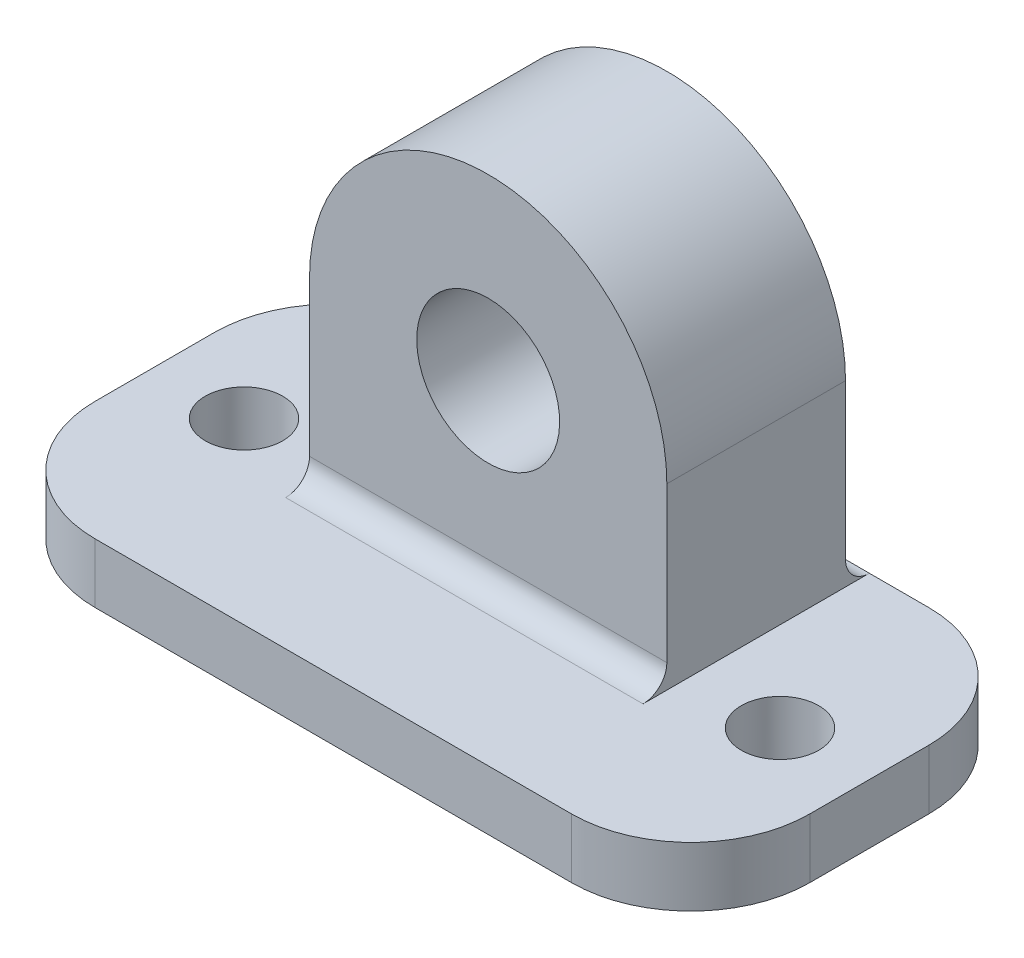
ISO-10303-21;
HEADER;
FILE_DESCRIPTION(('STEP AP214'),'2;1');
FILE_NAME('part.step','',(''),(''),'','','');
FILE_SCHEMA(('AUTOMOTIVE_DESIGN { 1 0 10303 214 1 1 1 1 }'));
ENDSEC;
DATA;
#1=APPLICATION_CONTEXT('core data for automotive mechanical design processes');
#2=APPLICATION_PROTOCOL_DEFINITION('international standard','automotive_design',2000,#1);
#3=PRODUCT_CONTEXT('',#1,'mechanical');
#4=PRODUCT('Part','Part','',(#3));
#5=PRODUCT_RELATED_PRODUCT_CATEGORY('part','',(#4));
#6=PRODUCT_DEFINITION_FORMATION('','',#4);
#7=PRODUCT_DEFINITION_CONTEXT('part definition',#1,'design');
#8=PRODUCT_DEFINITION('design','',#6,#7);
#9=PRODUCT_DEFINITION_SHAPE('','',#8);
#10=(LENGTH_UNIT() NAMED_UNIT(*) SI_UNIT(.MILLI.,.METRE.));
#11=(NAMED_UNIT(*) PLANE_ANGLE_UNIT() SI_UNIT($,.RADIAN.));
#12=(NAMED_UNIT(*) SI_UNIT($,.STERADIAN.) SOLID_ANGLE_UNIT());
#13=UNCERTAINTY_MEASURE_WITH_UNIT(LENGTH_MEASURE(1.E-05),#10,'distance_accuracy_value','');
#14=(GEOMETRIC_REPRESENTATION_CONTEXT(3) GLOBAL_UNCERTAINTY_ASSIGNED_CONTEXT((#13)) GLOBAL_UNIT_ASSIGNED_CONTEXT((#10,
#11,#12)) REPRESENTATION_CONTEXT('',''));
#15=CARTESIAN_POINT('',(0.,0.,0.));
#16=DIRECTION('',(0.,0.,1.));
#17=DIRECTION('',(1.,0.,0.));
#18=AXIS2_PLACEMENT_3D('',#15,#16,#17);
#19=CARTESIAN_POINT('',(0.,16.6666666666667,30.));
#20=DIRECTION('',(0.,0.,1.));
#21=DIRECTION('',(1.,0.,0.));
#22=AXIS2_PLACEMENT_3D('',#19,#20,#21);
#23=PLANE('',#22);
#24=DIRECTION('',(1.,0.,0.));
#25=VECTOR('',#24,1.);
#26=CARTESIAN_POINT('',(-30.,-3.33333333333333,30.));
#27=LINE('',#26,#25);
#28=CARTESIAN_POINT('',(-20.,-3.33333333333333,30.));
#29=VERTEX_POINT('',#28);
#30=CARTESIAN_POINT('',(20.,-3.33333333333333,30.));
#31=VERTEX_POINT('',#30);
#32=EDGE_CURVE('E254',#29,#31,#27,.T.);
#33=ORIENTED_EDGE('',*,*,#32,.T.);
#34=DIRECTION('',(0.,1.,0.));
#35=VECTOR('',#34,1.);
#36=CARTESIAN_POINT('',(20.,1.66666666666668,30.));
#37=LINE('',#36,#35);
#38=CARTESIAN_POINT('',(20.,1.66666666666667,30.));
#39=VERTEX_POINT('',#38);
#40=EDGE_CURVE('E235',#31,#39,#37,.T.);
#41=ORIENTED_EDGE('',*,*,#40,.T.);
#42=DIRECTION('',(-1.,0.,0.));
#43=VECTOR('',#42,1.);
#44=CARTESIAN_POINT('',(15.,1.66666666666667,30.));
#45=LINE('',#44,#43);
#46=CARTESIAN_POINT('',(-20.,1.66666666666667,30.));
#47=VERTEX_POINT('',#46);
#48=EDGE_CURVE('E266',#39,#47,#45,.T.);
#49=ORIENTED_EDGE('',*,*,#48,.T.);
#50=DIRECTION('',(0.,-1.,0.));
#51=VECTOR('',#50,1.);
#52=CARTESIAN_POINT('',(-20.,-3.33333333333333,30.));
#53=LINE('',#52,#51);
#54=EDGE_CURVE('E232',#47,#29,#53,.T.);
#55=ORIENTED_EDGE('',*,*,#54,.T.);
#56=EDGE_LOOP('',(#33,#41,#49,#55));
#57=FACE_BOUND('',#56,.T.);
#58=ADVANCED_FACE('F34',(#57),#23,.T.);
#59=CARTESIAN_POINT('',(0.,16.6666666666667,0.));
#60=DIRECTION('',(0.,0.,1.));
#61=DIRECTION('',(1.,0.,0.));
#62=AXIS2_PLACEMENT_3D('',#59,#60,#61);
#63=PLANE('',#62);
#64=DIRECTION('',(1.,0.,0.));
#65=VECTOR('',#64,1.);
#66=CARTESIAN_POINT('',(-30.,-3.33333333333333,0.));
#67=LINE('',#66,#65);
#68=CARTESIAN_POINT('',(-20.,-3.33333333333333,0.));
#69=VERTEX_POINT('',#68);
#70=CARTESIAN_POINT('',(20.,-3.33333333333333,0.));
#71=VERTEX_POINT('',#70);
#72=EDGE_CURVE('E261',#69,#71,#67,.T.);
#73=ORIENTED_EDGE('',*,*,#72,.F.);
#74=DIRECTION('',(0.,-1.,0.));
#75=VECTOR('',#74,1.);
#76=CARTESIAN_POINT('',(-20.,16.6666666666667,0.));
#77=LINE('',#76,#75);
#78=CARTESIAN_POINT('',(-20.,1.66666666666667,0.));
#79=VERTEX_POINT('',#78);
#80=EDGE_CURVE('E224',#69,#79,#77,.F.);
#81=ORIENTED_EDGE('',*,*,#80,.T.);
#82=DIRECTION('',(-1.,0.,0.));
#83=VECTOR('',#82,1.);
#84=CARTESIAN_POINT('',(-30.,1.66666666666667,0.));
#85=LINE('',#84,#83);
#86=CARTESIAN_POINT('',(-15.,1.66666666666667,0.));
#87=VERTEX_POINT('',#86);
#88=EDGE_CURVE('E256',#87,#79,#85,.T.);
#89=ORIENTED_EDGE('',*,*,#88,.F.);
#90=CARTESIAN_POINT('',(15.,1.66666666666667,0.));
#91=VERTEX_POINT('',#90);
#92=EDGE_CURVE('E253',#91,#87,#85,.T.);
#93=ORIENTED_EDGE('',*,*,#92,.F.);
#94=CARTESIAN_POINT('',(20.,1.66666666666667,0.));
#95=VERTEX_POINT('',#94);
#96=EDGE_CURVE('E245',#95,#91,#85,.T.);
#97=ORIENTED_EDGE('',*,*,#96,.F.);
#98=DIRECTION('',(0.,1.,0.));
#99=VECTOR('',#98,1.);
#100=CARTESIAN_POINT('',(20.,16.6666666666667,0.));
#101=LINE('',#100,#99);
#102=EDGE_CURVE('E222',#95,#71,#101,.F.);
#103=ORIENTED_EDGE('',*,*,#102,.T.);
#104=EDGE_LOOP('',(#73,#81,#89,#93,#97,#103));
#105=FACE_BOUND('',#104,.T.);
#106=ADVANCED_FACE('F249',(#105),#63,.F.);
#107=CARTESIAN_POINT('',(-30.,1.66666666666667,30.));
#108=DIRECTION('',(1.,0.,0.));
#109=DIRECTION('',(0.,0.,-1.));
#110=AXIS2_PLACEMENT_3D('',#107,#108,#109);
#111=PLANE('',#110);
#112=DIRECTION('',(0.,0.,-1.));
#113=VECTOR('',#112,1.);
#114=CARTESIAN_POINT('',(-30.,1.66666666666667,30.));
#115=LINE('',#114,#113);
#116=CARTESIAN_POINT('',(-30.,1.66666666666667,20.));
#117=VERTEX_POINT('',#116);
#118=CARTESIAN_POINT('',(-30.,1.66666666666667,10.));
#119=VERTEX_POINT('',#118);
#120=EDGE_CURVE('E269',#117,#119,#115,.T.);
#121=ORIENTED_EDGE('',*,*,#120,.T.);
#122=DIRECTION('',(0.,-1.,0.));
#123=VECTOR('',#122,1.);
#124=CARTESIAN_POINT('',(-30.,1.66666666666667,10.));
#125=LINE('',#124,#123);
#126=CARTESIAN_POINT('',(-30.,-3.33333333333333,10.));
#127=VERTEX_POINT('',#126);
#128=EDGE_CURVE('E211',#119,#127,#125,.T.);
#129=ORIENTED_EDGE('',*,*,#128,.T.);
#130=DIRECTION('',(0.,0.,-1.));
#131=VECTOR('',#130,1.);
#132=CARTESIAN_POINT('',(-30.,-3.33333333333333,30.));
#133=LINE('',#132,#131);
#134=CARTESIAN_POINT('',(-30.,-3.33333333333333,20.));
#135=VERTEX_POINT('',#134);
#136=EDGE_CURVE('E177',#135,#127,#133,.T.);
#137=ORIENTED_EDGE('',*,*,#136,.F.);
#138=DIRECTION('',(0.,-1.,0.));
#139=VECTOR('',#138,1.);
#140=CARTESIAN_POINT('',(-30.,1.66666666666667,20.));
#141=LINE('',#140,#139);
#142=EDGE_CURVE('E209',#135,#117,#141,.F.);
#143=ORIENTED_EDGE('',*,*,#142,.T.);
#144=EDGE_LOOP('',(#121,#129,#137,#143));
#145=FACE_BOUND('',#144,.T.);
#146=ADVANCED_FACE('F300',(#145),#111,.F.);
#147=CARTESIAN_POINT('',(-30.,-3.33333333333333,30.));
#148=DIRECTION('',(0.,1.,0.));
#149=DIRECTION('',(-1.,0.,0.));
#150=AXIS2_PLACEMENT_3D('',#147,#148,#149);
#151=PLANE('',#150);
#152=CARTESIAN_POINT('',(-22.5,-3.33333333333333,15.));
#153=DIRECTION('',(0.,1.,0.));
#154=DIRECTION('',(-1.,0.,0.));
#155=AXIS2_PLACEMENT_3D('',#152,#153,#154);
#156=CIRCLE('',#155,3.25);
#157=CARTESIAN_POINT('',(-25.75,-3.33333333333333,15.));
#158=VERTEX_POINT('',#157);
#159=EDGE_CURVE('E158',#158,#158,#156,.T.);
#160=ORIENTED_EDGE('',*,*,#159,.T.);
#161=EDGE_LOOP('',(#160));
#162=FACE_BOUND('',#161,.T.);
#163=CARTESIAN_POINT('',(22.5,-3.33333333333332,15.));
#164=DIRECTION('',(0.,1.,0.));
#165=DIRECTION('',(-1.,0.,0.));
#166=AXIS2_PLACEMENT_3D('',#163,#164,#165);
#167=CIRCLE('',#166,3.25);
#168=CARTESIAN_POINT('',(19.25,-3.33333333333332,15.));
#169=VERTEX_POINT('',#168);
#170=EDGE_CURVE('E189',#169,#169,#167,.T.);
#171=ORIENTED_EDGE('',*,*,#170,.T.);
#172=EDGE_LOOP('',(#171));
#173=FACE_BOUND('',#172,.T.);
#174=ORIENTED_EDGE('',*,*,#136,.T.);
#175=CARTESIAN_POINT('',(-20.,-3.33333333333333,10.));
#176=DIRECTION('',(0.,1.,0.));
#177=DIRECTION('',(-1.,0.,0.));
#178=AXIS2_PLACEMENT_3D('',#175,#176,#177);
#179=CIRCLE('',#178,10.);
#180=EDGE_CURVE('E220',#127,#69,#179,.F.);
#181=ORIENTED_EDGE('',*,*,#180,.T.);
#182=ORIENTED_EDGE('',*,*,#72,.T.);
#183=CARTESIAN_POINT('',(20.,-3.33333333333333,10.));
#184=DIRECTION('',(0.,1.,0.));
#185=DIRECTION('',(-1.,0.,0.));
#186=AXIS2_PLACEMENT_3D('',#183,#184,#185);
#187=CIRCLE('',#186,10.);
#188=CARTESIAN_POINT('',(30.,-3.33333333333332,10.));
#189=VERTEX_POINT('',#188);
#190=EDGE_CURVE('E216',#71,#189,#187,.F.);
#191=ORIENTED_EDGE('',*,*,#190,.T.);
#192=DIRECTION('',(0.,0.,-1.));
#193=VECTOR('',#192,1.);
#194=CARTESIAN_POINT('',(30.,-3.33333333333332,30.));
#195=LINE('',#194,#193);
#196=CARTESIAN_POINT('',(30.,-3.33333333333332,20.));
#197=VERTEX_POINT('',#196);
#198=EDGE_CURVE('E174',#197,#189,#195,.T.);
#199=ORIENTED_EDGE('',*,*,#198,.F.);
#200=CARTESIAN_POINT('',(20.,-3.33333333333332,20.));
#201=DIRECTION('',(0.,1.,0.));
#202=DIRECTION('',(-1.,0.,0.));
#203=AXIS2_PLACEMENT_3D('',#200,#201,#202);
#204=CIRCLE('',#203,10.);
#205=EDGE_CURVE('E218',#197,#31,#204,.F.);
#206=ORIENTED_EDGE('',*,*,#205,.T.);
#207=ORIENTED_EDGE('',*,*,#32,.F.);
#208=CARTESIAN_POINT('',(-20.,-3.33333333333333,20.));
#209=DIRECTION('',(0.,1.,0.));
#210=DIRECTION('',(-1.,0.,0.));
#211=AXIS2_PLACEMENT_3D('',#208,#209,#210);
#212=CIRCLE('',#211,10.);
#213=EDGE_CURVE('E214',#29,#135,#212,.F.);
#214=ORIENTED_EDGE('',*,*,#213,.T.);
#215=EDGE_LOOP('',(#174,#181,#182,#191,#199,#206,#207,#214));
#216=FACE_BOUND('',#215,.T.);
#217=ADVANCED_FACE('F259',(#162,#173,#216),#151,.F.);
#218=CARTESIAN_POINT('',(30.,1.66666666666668,30.));
#219=DIRECTION('',(-1.,0.,0.));
#220=DIRECTION('',(0.,0.,1.));
#221=AXIS2_PLACEMENT_3D('',#218,#219,#220);
#222=PLANE('',#221);
#223=DIRECTION('',(0.,0.,-1.));
#224=VECTOR('',#223,1.);
#225=CARTESIAN_POINT('',(30.,1.66666666666668,30.));
#226=LINE('',#225,#224);
#227=CARTESIAN_POINT('',(30.,1.66666666666668,20.));
#228=VERTEX_POINT('',#227);
#229=CARTESIAN_POINT('',(30.,1.66666666666668,10.));
#230=VERTEX_POINT('',#229);
#231=EDGE_CURVE('E167',#228,#230,#226,.T.);
#232=ORIENTED_EDGE('',*,*,#231,.F.);
#233=DIRECTION('',(0.,1.,0.));
#234=VECTOR('',#233,1.);
#235=CARTESIAN_POINT('',(30.,-3.33333333333332,20.));
#236=LINE('',#235,#234);
#237=EDGE_CURVE('E11',#228,#197,#236,.F.);
#238=ORIENTED_EDGE('',*,*,#237,.T.);
#239=ORIENTED_EDGE('',*,*,#198,.T.);
#240=DIRECTION('',(0.,1.,0.));
#241=VECTOR('',#240,1.);
#242=CARTESIAN_POINT('',(30.,1.66666666666668,10.));
#243=LINE('',#242,#241);
#244=EDGE_CURVE('E42',#189,#230,#243,.T.);
#245=ORIENTED_EDGE('',*,*,#244,.T.);
#246=EDGE_LOOP('',(#232,#238,#239,#245));
#247=FACE_BOUND('',#246,.T.);
#248=ADVANCED_FACE('F238',(#247),#222,.F.);
#249=CARTESIAN_POINT('',(15.,16.6666666666667,30.));
#250=DIRECTION('',(-1.,0.,0.));
#251=DIRECTION('',(0.,0.,1.));
#252=AXIS2_PLACEMENT_3D('',#249,#250,#251);
#253=PLANE('',#252);
#254=DIRECTION('',(0.,0.,-1.));
#255=VECTOR('',#254,1.);
#256=CARTESIAN_POINT('',(15.,16.6666666666667,30.));
#257=LINE('',#256,#255);
#258=CARTESIAN_POINT('',(15.,16.6666666666667,17.));
#259=VERTEX_POINT('',#258);
#260=CARTESIAN_POINT('',(15.,16.6666666666667,2.));
#261=VERTEX_POINT('',#260);
#262=EDGE_CURVE('E154',#259,#261,#257,.T.);
#263=ORIENTED_EDGE('',*,*,#262,.F.);
#264=DIRECTION('',(0.,1.,0.));
#265=VECTOR('',#264,1.);
#266=CARTESIAN_POINT('',(15.,31.6666666666667,17.));
#267=LINE('',#266,#265);
#268=CARTESIAN_POINT('',(15.,3.66666666666668,17.));
#269=VERTEX_POINT('',#268);
#270=EDGE_CURVE('E351',#269,#259,#267,.T.);
#271=ORIENTED_EDGE('',*,*,#270,.F.);
#272=CARTESIAN_POINT('',(15.,3.66666666666668,19.));
#273=DIRECTION('',(-1.,0.,0.));
#274=DIRECTION('',(0.,0.,1.));
#275=AXIS2_PLACEMENT_3D('',#272,#273,#274);
#276=CIRCLE('',#275,2.);
#277=CARTESIAN_POINT('',(15.,1.66666666666667,19.));
#278=VERTEX_POINT('',#277);
#279=EDGE_CURVE('E204',#269,#278,#276,.T.);
#280=ORIENTED_EDGE('',*,*,#279,.T.);
#281=DIRECTION('',(0.,0.,-1.));
#282=VECTOR('',#281,1.);
#283=CARTESIAN_POINT('',(15.,1.66666666666667,30.));
#284=LINE('',#283,#282);
#285=EDGE_CURVE('E164',#278,#91,#284,.T.);
#286=ORIENTED_EDGE('',*,*,#285,.T.);
#287=CARTESIAN_POINT('',(15.,3.66666666666667,0.));
#288=DIRECTION('',(-1.,0.,0.));
#289=DIRECTION('',(0.,0.,1.));
#290=AXIS2_PLACEMENT_3D('',#287,#288,#289);
#291=CIRCLE('',#290,2.);
#292=CARTESIAN_POINT('',(15.,3.66666666666668,2.));
#293=VERTEX_POINT('',#292);
#294=EDGE_CURVE('E157',#91,#293,#291,.T.);
#295=ORIENTED_EDGE('',*,*,#294,.T.);
#296=DIRECTION('',(0.,-1.,0.));
#297=VECTOR('',#296,1.);
#298=CARTESIAN_POINT('',(15.,31.6666666666667,2.));
#299=LINE('',#298,#297);
#300=EDGE_CURVE('E139',#261,#293,#299,.T.);
#301=ORIENTED_EDGE('',*,*,#300,.F.);
#302=EDGE_LOOP('',(#263,#271,#280,#286,#295,#301));
#303=FACE_BOUND('',#302,.T.);
#304=ADVANCED_FACE('F152',(#303),#253,.F.);
#305=CARTESIAN_POINT('',(0.,16.6666666666667,30.));
#306=DIRECTION('',(0.,0.,-1.));
#307=DIRECTION('',(-1.,0.,0.));
#308=AXIS2_PLACEMENT_3D('',#305,#306,#307);
#309=CYLINDRICAL_SURFACE('',#308,15.);
#310=CARTESIAN_POINT('',(0.,16.6666666666667,17.));
#311=DIRECTION('',(0.,0.,-1.));
#312=DIRECTION('',(0.,1.,0.));
#313=AXIS2_PLACEMENT_3D('',#310,#311,#312);
#314=CIRCLE('',#313,15.);
#315=CARTESIAN_POINT('',(-15.,16.6666666666667,17.));
#316=VERTEX_POINT('',#315);
#317=EDGE_CURVE('E163',#316,#259,#314,.T.);
#318=ORIENTED_EDGE('',*,*,#317,.T.);
#319=ORIENTED_EDGE('',*,*,#262,.T.);
#320=CARTESIAN_POINT('',(0.,16.6666666666667,2.));
#321=DIRECTION('',(0.,0.,1.));
#322=DIRECTION('',(1.,0.,0.));
#323=AXIS2_PLACEMENT_3D('',#320,#321,#322);
#324=CIRCLE('',#323,15.);
#325=CARTESIAN_POINT('',(-15.,16.6666666666667,2.));
#326=VERTEX_POINT('',#325);
#327=EDGE_CURVE('E136',#261,#326,#324,.T.);
#328=ORIENTED_EDGE('',*,*,#327,.T.);
#329=DIRECTION('',(0.,0.,-1.));
#330=VECTOR('',#329,1.);
#331=CARTESIAN_POINT('',(-15.,16.6666666666667,30.));
#332=LINE('',#331,#330);
#333=EDGE_CURVE('E165',#316,#326,#332,.T.);
#334=ORIENTED_EDGE('',*,*,#333,.F.);
#335=EDGE_LOOP('',(#318,#319,#328,#334));
#336=FACE_BOUND('',#335,.T.);
#337=ADVANCED_FACE('F161',(#336),#309,.T.);
#338=CARTESIAN_POINT('',(-15.,16.6666666666667,30.));
#339=DIRECTION('',(1.,0.,0.));
#340=DIRECTION('',(0.,0.,-1.));
#341=AXIS2_PLACEMENT_3D('',#338,#339,#340);
#342=PLANE('',#341);
#343=DIRECTION('',(0.,0.,-1.));
#344=VECTOR('',#343,1.);
#345=CARTESIAN_POINT('',(-15.,1.66666666666667,30.));
#346=LINE('',#345,#344);
#347=CARTESIAN_POINT('',(-15.,1.66666666666667,19.));
#348=VERTEX_POINT('',#347);
#349=EDGE_CURVE('E169',#348,#87,#346,.T.);
#350=ORIENTED_EDGE('',*,*,#349,.F.);
#351=CARTESIAN_POINT('',(-15.,3.66666666666667,19.));
#352=DIRECTION('',(1.,0.,0.));
#353=DIRECTION('',(0.,0.,-1.));
#354=AXIS2_PLACEMENT_3D('',#351,#352,#353);
#355=CIRCLE('',#354,2.);
#356=CARTESIAN_POINT('',(-15.,3.66666666666667,17.));
#357=VERTEX_POINT('',#356);
#358=EDGE_CURVE('E207',#348,#357,#355,.T.);
#359=ORIENTED_EDGE('',*,*,#358,.T.);
#360=DIRECTION('',(0.,1.,0.));
#361=VECTOR('',#360,1.);
#362=CARTESIAN_POINT('',(-15.,31.6666666666667,17.));
#363=LINE('',#362,#361);
#364=EDGE_CURVE('E183',#357,#316,#363,.T.);
#365=ORIENTED_EDGE('',*,*,#364,.T.);
#366=ORIENTED_EDGE('',*,*,#333,.T.);
#367=DIRECTION('',(0.,-1.,0.));
#368=VECTOR('',#367,1.);
#369=CARTESIAN_POINT('',(-15.,31.6666666666667,2.));
#370=LINE('',#369,#368);
#371=CARTESIAN_POINT('',(-15.,3.66666666666668,2.));
#372=VERTEX_POINT('',#371);
#373=EDGE_CURVE('E142',#326,#372,#370,.T.);
#374=ORIENTED_EDGE('',*,*,#373,.T.);
#375=CARTESIAN_POINT('',(-15.,3.66666666666667,0.));
#376=DIRECTION('',(1.,0.,0.));
#377=DIRECTION('',(0.,0.,-1.));
#378=AXIS2_PLACEMENT_3D('',#375,#376,#377);
#379=CIRCLE('',#378,2.);
#380=EDGE_CURVE('E201',#372,#87,#379,.T.);
#381=ORIENTED_EDGE('',*,*,#380,.T.);
#382=EDGE_LOOP('',(#350,#359,#365,#366,#374,#381));
#383=FACE_BOUND('',#382,.T.);
#384=ADVANCED_FACE('F276',(#383),#342,.F.);
#385=CARTESIAN_POINT('',(-30.,1.66666666666667,30.));
#386=DIRECTION('',(0.,-1.,0.));
#387=DIRECTION('',(1.,0.,0.));
#388=AXIS2_PLACEMENT_3D('',#385,#386,#387);
#389=PLANE('',#388);
#390=CARTESIAN_POINT('',(-22.5,1.66666666666667,15.));
#391=DIRECTION('',(0.,-1.,0.));
#392=DIRECTION('',(1.,0.,0.));
#393=AXIS2_PLACEMENT_3D('',#390,#391,#392);
#394=CIRCLE('',#393,3.25);
#395=CARTESIAN_POINT('',(-19.25,1.66666666666667,15.));
#396=VERTEX_POINT('',#395);
#397=EDGE_CURVE('E190',#396,#396,#394,.T.);
#398=ORIENTED_EDGE('',*,*,#397,.T.);
#399=EDGE_LOOP('',(#398));
#400=FACE_BOUND('',#399,.T.);
#401=CARTESIAN_POINT('',(22.5,1.66666666666668,15.));
#402=DIRECTION('',(0.,-1.,0.));
#403=DIRECTION('',(1.,0.,0.));
#404=AXIS2_PLACEMENT_3D('',#401,#402,#403);
#405=CIRCLE('',#404,3.25);
#406=CARTESIAN_POINT('',(25.75,1.66666666666668,15.));
#407=VERTEX_POINT('',#406);
#408=EDGE_CURVE('E186',#407,#407,#405,.T.);
#409=ORIENTED_EDGE('',*,*,#408,.T.);
#410=EDGE_LOOP('',(#409));
#411=FACE_BOUND('',#410,.T.);
#412=ORIENTED_EDGE('',*,*,#88,.T.);
#413=CARTESIAN_POINT('',(-20.,1.66666666666667,10.));
#414=DIRECTION('',(0.,-1.,0.));
#415=DIRECTION('',(1.,0.,0.));
#416=AXIS2_PLACEMENT_3D('',#413,#414,#415);
#417=CIRCLE('',#416,10.);
#418=EDGE_CURVE('E230',#79,#119,#417,.F.);
#419=ORIENTED_EDGE('',*,*,#418,.T.);
#420=ORIENTED_EDGE('',*,*,#120,.F.);
#421=CARTESIAN_POINT('',(-20.,1.66666666666667,20.));
#422=DIRECTION('',(0.,-1.,0.));
#423=DIRECTION('',(1.,0.,0.));
#424=AXIS2_PLACEMENT_3D('',#421,#422,#423);
#425=CIRCLE('',#424,10.);
#426=EDGE_CURVE('E226',#117,#47,#425,.F.);
#427=ORIENTED_EDGE('',*,*,#426,.T.);
#428=ORIENTED_EDGE('',*,*,#48,.F.);
#429=CARTESIAN_POINT('',(20.,1.66666666666667,20.));
#430=DIRECTION('',(0.,-1.,0.));
#431=DIRECTION('',(1.,0.,0.));
#432=AXIS2_PLACEMENT_3D('',#429,#430,#431);
#433=CIRCLE('',#432,10.);
#434=EDGE_CURVE('E57',#39,#228,#433,.F.);
#435=ORIENTED_EDGE('',*,*,#434,.T.);
#436=ORIENTED_EDGE('',*,*,#231,.T.);
#437=CARTESIAN_POINT('',(20.,1.66666666666667,10.));
#438=DIRECTION('',(0.,-1.,0.));
#439=DIRECTION('',(1.,0.,0.));
#440=AXIS2_PLACEMENT_3D('',#437,#438,#439);
#441=CIRCLE('',#440,10.);
#442=EDGE_CURVE('E49',#230,#95,#441,.F.);
#443=ORIENTED_EDGE('',*,*,#442,.T.);
#444=ORIENTED_EDGE('',*,*,#96,.T.);
#445=ORIENTED_EDGE('',*,*,#285,.F.);
#446=DIRECTION('',(1.,0.,0.));
#447=VECTOR('',#446,1.);
#448=CARTESIAN_POINT('',(-15.,1.66666666666667,19.));
#449=LINE('',#448,#447);
#450=EDGE_CURVE('E180',#278,#348,#449,.F.);
#451=ORIENTED_EDGE('',*,*,#450,.T.);
#452=ORIENTED_EDGE('',*,*,#349,.T.);
#453=EDGE_LOOP('',(#412,#419,#420,#427,#428,#435,#436,#443,#444,#445,#451,#452));
#454=FACE_BOUND('',#453,.T.);
#455=ADVANCED_FACE('F243',(#400,#411,#454),#389,.F.);
#456=CARTESIAN_POINT('',(-15.,31.6666666666667,2.));
#457=DIRECTION('',(0.,0.,1.));
#458=DIRECTION('',(1.,0.,0.));
#459=AXIS2_PLACEMENT_3D('',#456,#457,#458);
#460=PLANE('',#459);
#461=CARTESIAN_POINT('',(0.,16.6666666666667,2.));
#462=DIRECTION('',(0.,0.,1.));
#463=DIRECTION('',(1.,0.,0.));
#464=AXIS2_PLACEMENT_3D('',#461,#462,#463);
#465=CIRCLE('',#464,6.);
#466=CARTESIAN_POINT('',(6.,16.6666666666667,2.));
#467=VERTEX_POINT('',#466);
#468=EDGE_CURVE('E148',#467,#467,#465,.T.);
#469=ORIENTED_EDGE('',*,*,#468,.T.);
#470=EDGE_LOOP('',(#469));
#471=FACE_BOUND('',#470,.T.);
#472=ORIENTED_EDGE('',*,*,#300,.T.);
#473=DIRECTION('',(1.,0.,0.));
#474=VECTOR('',#473,1.);
#475=CARTESIAN_POINT('',(-15.,3.66666666666667,2.));
#476=LINE('',#475,#474);
#477=EDGE_CURVE('E195',#293,#372,#476,.F.);
#478=ORIENTED_EDGE('',*,*,#477,.T.);
#479=ORIENTED_EDGE('',*,*,#373,.F.);
#480=ORIENTED_EDGE('',*,*,#327,.F.);
#481=EDGE_LOOP('',(#472,#478,#479,#480));
#482=FACE_BOUND('',#481,.T.);
#483=ADVANCED_FACE('F138',(#471,#482),#460,.F.);
#484=CARTESIAN_POINT('',(-15.,31.6666666666667,17.));
#485=DIRECTION('',(0.,0.,-1.));
#486=DIRECTION('',(0.,1.,0.));
#487=AXIS2_PLACEMENT_3D('',#484,#485,#486);
#488=PLANE('',#487);
#489=CARTESIAN_POINT('',(0.,16.6666666666667,17.));
#490=DIRECTION('',(0.,0.,-1.));
#491=DIRECTION('',(0.,1.,0.));
#492=AXIS2_PLACEMENT_3D('',#489,#490,#491);
#493=CIRCLE('',#492,6.);
#494=CARTESIAN_POINT('',(0.,22.6666666666667,17.));
#495=VERTEX_POINT('',#494);
#496=EDGE_CURVE('E147',#495,#495,#493,.T.);
#497=ORIENTED_EDGE('',*,*,#496,.T.);
#498=EDGE_LOOP('',(#497));
#499=FACE_BOUND('',#498,.T.);
#500=ORIENTED_EDGE('',*,*,#364,.F.);
#501=DIRECTION('',(1.,0.,0.));
#502=VECTOR('',#501,1.);
#503=CARTESIAN_POINT('',(15.,3.66666666666668,17.));
#504=LINE('',#503,#502);
#505=EDGE_CURVE('E197',#357,#269,#504,.T.);
#506=ORIENTED_EDGE('',*,*,#505,.T.);
#507=ORIENTED_EDGE('',*,*,#270,.T.);
#508=ORIENTED_EDGE('',*,*,#317,.F.);
#509=EDGE_LOOP('',(#500,#506,#507,#508));
#510=FACE_BOUND('',#509,.T.);
#511=ADVANCED_FACE('F366',(#499,#510),#488,.F.);
#512=CARTESIAN_POINT('',(0.,16.6666666666667,30.));
#513=DIRECTION('',(0.,0.,-1.));
#514=DIRECTION('',(-1.,0.,0.));
#515=AXIS2_PLACEMENT_3D('',#512,#513,#514);
#516=CYLINDRICAL_SURFACE('',#515,6.);
#517=ORIENTED_EDGE('',*,*,#496,.F.);
#518=EDGE_LOOP('',(#517));
#519=FACE_BOUND('',#518,.T.);
#520=ORIENTED_EDGE('',*,*,#468,.F.);
#521=EDGE_LOOP('',(#520));
#522=FACE_BOUND('',#521,.T.);
#523=ADVANCED_FACE('F304',(#519,#522),#516,.F.);
#524=CARTESIAN_POINT('',(22.5,-15.,15.));
#525=DIRECTION('',(0.,1.,0.));
#526=DIRECTION('',(0.,0.,1.));
#527=AXIS2_PLACEMENT_3D('',#524,#525,#526);
#528=CYLINDRICAL_SURFACE('',#527,3.25);
#529=ORIENTED_EDGE('',*,*,#408,.F.);
#530=EDGE_LOOP('',(#529));
#531=FACE_BOUND('',#530,.T.);
#532=ORIENTED_EDGE('',*,*,#170,.F.);
#533=EDGE_LOOP('',(#532));
#534=FACE_BOUND('',#533,.T.);
#535=ADVANCED_FACE('F290',(#531,#534),#528,.F.);
#536=CARTESIAN_POINT('',(-22.5,-15.,15.));
#537=DIRECTION('',(0.,1.,0.));
#538=DIRECTION('',(0.,0.,1.));
#539=AXIS2_PLACEMENT_3D('',#536,#537,#538);
#540=CYLINDRICAL_SURFACE('',#539,3.25);
#541=ORIENTED_EDGE('',*,*,#397,.F.);
#542=EDGE_LOOP('',(#541));
#543=FACE_BOUND('',#542,.T.);
#544=ORIENTED_EDGE('',*,*,#159,.F.);
#545=EDGE_LOOP('',(#544));
#546=FACE_BOUND('',#545,.T.);
#547=ADVANCED_FACE('F281',(#543,#546),#540,.F.);
#548=CARTESIAN_POINT('',(-30.,3.66666666666667,0.));
#549=DIRECTION('',(-1.,0.,0.));
#550=DIRECTION('',(0.,-1.,0.));
#551=AXIS2_PLACEMENT_3D('',#548,#549,#550);
#552=CYLINDRICAL_SURFACE('',#551,2.);
#553=ORIENTED_EDGE('',*,*,#380,.F.);
#554=ORIENTED_EDGE('',*,*,#477,.F.);
#555=ORIENTED_EDGE('',*,*,#294,.F.);
#556=ORIENTED_EDGE('',*,*,#92,.T.);
#557=EDGE_LOOP('',(#553,#554,#555,#556));
#558=FACE_BOUND('',#557,.T.);
#559=ADVANCED_FACE('F278',(#558),#552,.F.);
#560=CARTESIAN_POINT('',(-15.,3.66666666666667,19.));
#561=DIRECTION('',(-1.,0.,0.));
#562=DIRECTION('',(0.,-1.,0.));
#563=AXIS2_PLACEMENT_3D('',#560,#561,#562);
#564=CYLINDRICAL_SURFACE('',#563,2.);
#565=ORIENTED_EDGE('',*,*,#358,.F.);
#566=ORIENTED_EDGE('',*,*,#450,.F.);
#567=ORIENTED_EDGE('',*,*,#279,.F.);
#568=ORIENTED_EDGE('',*,*,#505,.F.);
#569=EDGE_LOOP('',(#565,#566,#567,#568));
#570=FACE_BOUND('',#569,.T.);
#571=ADVANCED_FACE('F280',(#570),#564,.F.);
#572=CARTESIAN_POINT('',(-20.,1.66666666666667,10.));
#573=DIRECTION('',(0.,-1.,0.));
#574=DIRECTION('',(0.,0.,-1.));
#575=AXIS2_PLACEMENT_3D('',#572,#573,#574);
#576=CYLINDRICAL_SURFACE('',#575,10.);
#577=ORIENTED_EDGE('',*,*,#418,.F.);
#578=ORIENTED_EDGE('',*,*,#80,.F.);
#579=ORIENTED_EDGE('',*,*,#180,.F.);
#580=ORIENTED_EDGE('',*,*,#128,.F.);
#581=EDGE_LOOP('',(#577,#578,#579,#580));
#582=FACE_BOUND('',#581,.T.);
#583=ADVANCED_FACE('F287',(#582),#576,.T.);
#584=CARTESIAN_POINT('',(20.,16.6666666666667,20.));
#585=DIRECTION('',(0.,-1.,0.));
#586=DIRECTION('',(0.,0.,-1.));
#587=AXIS2_PLACEMENT_3D('',#584,#585,#586);
#588=CYLINDRICAL_SURFACE('',#587,10.);
#589=ORIENTED_EDGE('',*,*,#205,.F.);
#590=ORIENTED_EDGE('',*,*,#237,.F.);
#591=ORIENTED_EDGE('',*,*,#434,.F.);
#592=ORIENTED_EDGE('',*,*,#40,.F.);
#593=EDGE_LOOP('',(#589,#590,#591,#592));
#594=FACE_BOUND('',#593,.T.);
#595=ADVANCED_FACE('F331',(#594),#588,.T.);
#596=CARTESIAN_POINT('',(20.,1.66666666666668,10.));
#597=DIRECTION('',(0.,1.,0.));
#598=DIRECTION('',(0.,0.,1.));
#599=AXIS2_PLACEMENT_3D('',#596,#597,#598);
#600=CYLINDRICAL_SURFACE('',#599,10.);
#601=ORIENTED_EDGE('',*,*,#190,.F.);
#602=ORIENTED_EDGE('',*,*,#102,.F.);
#603=ORIENTED_EDGE('',*,*,#442,.F.);
#604=ORIENTED_EDGE('',*,*,#244,.F.);
#605=EDGE_LOOP('',(#601,#602,#603,#604));
#606=FACE_BOUND('',#605,.T.);
#607=ADVANCED_FACE('F257',(#606),#600,.T.);
#608=CARTESIAN_POINT('',(-20.,16.6666666666667,20.));
#609=DIRECTION('',(0.,1.,0.));
#610=DIRECTION('',(0.,0.,1.));
#611=AXIS2_PLACEMENT_3D('',#608,#609,#610);
#612=CYLINDRICAL_SURFACE('',#611,10.);
#613=ORIENTED_EDGE('',*,*,#426,.F.);
#614=ORIENTED_EDGE('',*,*,#142,.F.);
#615=ORIENTED_EDGE('',*,*,#213,.F.);
#616=ORIENTED_EDGE('',*,*,#54,.F.);
#617=EDGE_LOOP('',(#613,#614,#615,#616));
#618=FACE_BOUND('',#617,.T.);
#619=ADVANCED_FACE('F36',(#618),#612,.T.);
#620=CLOSED_SHELL('',(#58,#106,#146,#217,#248,#304,#337,#384,#455,#483,#511,#523,#535,#547,#559,
#571,#583,#595,#607,#619));
#621=MANIFOLD_SOLID_BREP('B2',#620);
#622=ADVANCED_BREP_SHAPE_REPRESENTATION('',(#18,#621),#14);
#623=SHAPE_DEFINITION_REPRESENTATION(#9,#622);
ENDSEC;
END-ISO-10303-21;
